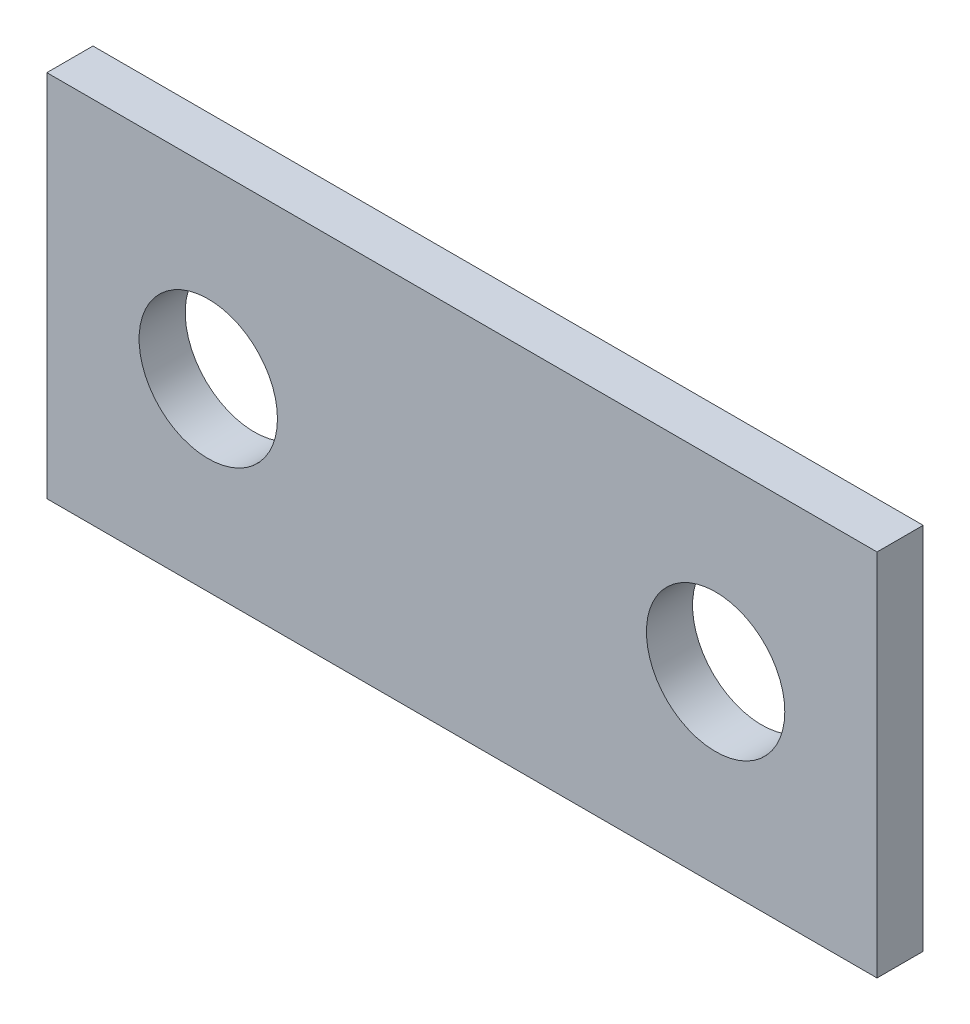
ISO-10303-21;
HEADER;
FILE_DESCRIPTION(('STEP AP214'),'2;1');
FILE_NAME('part.step','',(''),(''),'','','');
FILE_SCHEMA(('AUTOMOTIVE_DESIGN { 1 0 10303 214 1 1 1 1 }'));
ENDSEC;
DATA;
#1=APPLICATION_CONTEXT('core data for automotive mechanical design processes');
#2=APPLICATION_PROTOCOL_DEFINITION('international standard','automotive_design',2000,#1);
#3=PRODUCT_CONTEXT('',#1,'mechanical');
#4=PRODUCT('Part','Part','',(#3));
#5=PRODUCT_RELATED_PRODUCT_CATEGORY('part','',(#4));
#6=PRODUCT_DEFINITION_FORMATION('','',#4);
#7=PRODUCT_DEFINITION_CONTEXT('part definition',#1,'design');
#8=PRODUCT_DEFINITION('design','',#6,#7);
#9=PRODUCT_DEFINITION_SHAPE('','',#8);
#10=(LENGTH_UNIT() NAMED_UNIT(*) SI_UNIT(.MILLI.,.METRE.));
#11=(NAMED_UNIT(*) PLANE_ANGLE_UNIT() SI_UNIT($,.RADIAN.));
#12=(NAMED_UNIT(*) SI_UNIT($,.STERADIAN.) SOLID_ANGLE_UNIT());
#13=UNCERTAINTY_MEASURE_WITH_UNIT(LENGTH_MEASURE(1.E-05),#10,'distance_accuracy_value','');
#14=(GEOMETRIC_REPRESENTATION_CONTEXT(3) GLOBAL_UNCERTAINTY_ASSIGNED_CONTEXT((#13)) GLOBAL_UNIT_ASSIGNED_CONTEXT((#10,
#11,#12)) REPRESENTATION_CONTEXT('',''));
#15=CARTESIAN_POINT('',(0.,0.,0.));
#16=DIRECTION('',(0.,0.,1.));
#17=DIRECTION('',(1.,0.,0.));
#18=AXIS2_PLACEMENT_3D('',#15,#16,#17);
#19=CARTESIAN_POINT('',(-28.575,12.7,3.175));
#20=DIRECTION('',(0.,0.,1.));
#21=DIRECTION('',(1.,0.,0.));
#22=AXIS2_PLACEMENT_3D('',#19,#20,#21);
#23=PLANE('',#22);
#24=CARTESIAN_POINT('',(-17.4625,0.,3.175));
#25=DIRECTION('',(0.,0.,1.));
#26=DIRECTION('',(1.,0.,0.));
#27=AXIS2_PLACEMENT_3D('',#24,#25,#26);
#28=CIRCLE('',#27,4.7625);
#29=CARTESIAN_POINT('',(-12.7,0.,3.175));
#30=VERTEX_POINT('',#29);
#31=EDGE_CURVE('E101',#30,#30,#28,.T.);
#32=ORIENTED_EDGE('',*,*,#31,.F.);
#33=EDGE_LOOP('',(#32));
#34=FACE_BOUND('',#33,.T.);
#35=DIRECTION('',(0.,-1.,0.));
#36=VECTOR('',#35,1.);
#37=CARTESIAN_POINT('',(-28.575,-12.7,3.175));
#38=LINE('',#37,#36);
#39=CARTESIAN_POINT('',(-28.575,12.7,3.175));
#40=VERTEX_POINT('',#39);
#41=CARTESIAN_POINT('',(-28.575,-12.7,3.175));
#42=VERTEX_POINT('',#41);
#43=EDGE_CURVE('E86',#40,#42,#38,.T.);
#44=ORIENTED_EDGE('',*,*,#43,.T.);
#45=DIRECTION('',(1.,0.,0.));
#46=VECTOR('',#45,1.);
#47=CARTESIAN_POINT('',(28.575,-12.7,3.175));
#48=LINE('',#47,#46);
#49=CARTESIAN_POINT('',(28.575,-12.7,3.175));
#50=VERTEX_POINT('',#49);
#51=EDGE_CURVE('E81',#42,#50,#48,.T.);
#52=ORIENTED_EDGE('',*,*,#51,.T.);
#53=DIRECTION('',(0.,1.,0.));
#54=VECTOR('',#53,1.);
#55=CARTESIAN_POINT('',(28.575,-12.7,3.175));
#56=LINE('',#55,#54);
#57=CARTESIAN_POINT('',(28.575,12.7,3.175));
#58=VERTEX_POINT('',#57);
#59=EDGE_CURVE('E84',#50,#58,#56,.T.);
#60=ORIENTED_EDGE('',*,*,#59,.T.);
#61=DIRECTION('',(-1.,0.,0.));
#62=VECTOR('',#61,1.);
#63=CARTESIAN_POINT('',(28.575,12.7,3.175));
#64=LINE('',#63,#62);
#65=EDGE_CURVE('E51',#58,#40,#64,.T.);
#66=ORIENTED_EDGE('',*,*,#65,.T.);
#67=EDGE_LOOP('',(#44,#52,#60,#66));
#68=FACE_BOUND('',#67,.T.);
#69=CARTESIAN_POINT('',(17.4625,0.,3.175));
#70=DIRECTION('',(0.,0.,1.));
#71=DIRECTION('',(1.,0.,0.));
#72=AXIS2_PLACEMENT_3D('',#69,#70,#71);
#73=CIRCLE('',#72,4.7625);
#74=CARTESIAN_POINT('',(22.225,0.,3.175));
#75=VERTEX_POINT('',#74);
#76=EDGE_CURVE('E116',#75,#75,#73,.T.);
#77=ORIENTED_EDGE('',*,*,#76,.F.);
#78=EDGE_LOOP('',(#77));
#79=FACE_BOUND('',#78,.T.);
#80=ADVANCED_FACE('F34',(#34,#68,#79),#23,.T.);
#81=CARTESIAN_POINT('',(-28.575,12.7,0.));
#82=DIRECTION('',(0.,0.,1.));
#83=DIRECTION('',(1.,0.,0.));
#84=AXIS2_PLACEMENT_3D('',#81,#82,#83);
#85=PLANE('',#84);
#86=CARTESIAN_POINT('',(-17.4625,0.,0.));
#87=DIRECTION('',(0.,0.,1.));
#88=DIRECTION('',(1.,0.,0.));
#89=AXIS2_PLACEMENT_3D('',#86,#87,#88);
#90=CIRCLE('',#89,4.7625);
#91=CARTESIAN_POINT('',(-12.7,0.,0.));
#92=VERTEX_POINT('',#91);
#93=EDGE_CURVE('E113',#92,#92,#90,.T.);
#94=ORIENTED_EDGE('',*,*,#93,.T.);
#95=EDGE_LOOP('',(#94));
#96=FACE_BOUND('',#95,.T.);
#97=DIRECTION('',(0.,-1.,0.));
#98=VECTOR('',#97,1.);
#99=CARTESIAN_POINT('',(-28.575,-12.7,0.));
#100=LINE('',#99,#98);
#101=CARTESIAN_POINT('',(-28.575,12.7,0.));
#102=VERTEX_POINT('',#101);
#103=CARTESIAN_POINT('',(-28.575,-12.7,0.));
#104=VERTEX_POINT('',#103);
#105=EDGE_CURVE('E98',#102,#104,#100,.T.);
#106=ORIENTED_EDGE('',*,*,#105,.F.);
#107=DIRECTION('',(-1.,0.,0.));
#108=VECTOR('',#107,1.);
#109=CARTESIAN_POINT('',(28.575,12.7,0.));
#110=LINE('',#109,#108);
#111=CARTESIAN_POINT('',(28.575,12.7,0.));
#112=VERTEX_POINT('',#111);
#113=EDGE_CURVE('E74',#112,#102,#110,.T.);
#114=ORIENTED_EDGE('',*,*,#113,.F.);
#115=DIRECTION('',(0.,1.,0.));
#116=VECTOR('',#115,1.);
#117=CARTESIAN_POINT('',(28.575,-12.7,0.));
#118=LINE('',#117,#116);
#119=CARTESIAN_POINT('',(28.575,-12.7,0.));
#120=VERTEX_POINT('',#119);
#121=EDGE_CURVE('E68',#120,#112,#118,.T.);
#122=ORIENTED_EDGE('',*,*,#121,.F.);
#123=DIRECTION('',(1.,0.,0.));
#124=VECTOR('',#123,1.);
#125=CARTESIAN_POINT('',(28.575,-12.7,0.));
#126=LINE('',#125,#124);
#127=EDGE_CURVE('E90',#104,#120,#126,.T.);
#128=ORIENTED_EDGE('',*,*,#127,.F.);
#129=EDGE_LOOP('',(#106,#114,#122,#128));
#130=FACE_BOUND('',#129,.T.);
#131=CARTESIAN_POINT('',(17.4625,0.,0.));
#132=DIRECTION('',(0.,0.,1.));
#133=DIRECTION('',(1.,0.,0.));
#134=AXIS2_PLACEMENT_3D('',#131,#132,#133);
#135=CIRCLE('',#134,4.7625);
#136=CARTESIAN_POINT('',(22.225,0.,0.));
#137=VERTEX_POINT('',#136);
#138=EDGE_CURVE('E119',#137,#137,#135,.T.);
#139=ORIENTED_EDGE('',*,*,#138,.T.);
#140=EDGE_LOOP('',(#139));
#141=FACE_BOUND('',#140,.T.);
#142=ADVANCED_FACE('F109',(#96,#130,#141),#85,.F.);
#143=CARTESIAN_POINT('',(-28.575,-12.7,3.175));
#144=DIRECTION('',(1.,0.,0.));
#145=DIRECTION('',(0.,0.,-1.));
#146=AXIS2_PLACEMENT_3D('',#143,#144,#145);
#147=PLANE('',#146);
#148=ORIENTED_EDGE('',*,*,#105,.T.);
#149=DIRECTION('',(0.,0.,-1.));
#150=VECTOR('',#149,1.);
#151=CARTESIAN_POINT('',(-28.575,-12.7,3.175));
#152=LINE('',#151,#150);
#153=EDGE_CURVE('E11',#42,#104,#152,.T.);
#154=ORIENTED_EDGE('',*,*,#153,.F.);
#155=ORIENTED_EDGE('',*,*,#43,.F.);
#156=DIRECTION('',(0.,0.,-1.));
#157=VECTOR('',#156,1.);
#158=CARTESIAN_POINT('',(-28.575,12.7,3.175));
#159=LINE('',#158,#157);
#160=EDGE_CURVE('E94',#40,#102,#159,.T.);
#161=ORIENTED_EDGE('',*,*,#160,.T.);
#162=EDGE_LOOP('',(#148,#154,#155,#161));
#163=FACE_BOUND('',#162,.T.);
#164=ADVANCED_FACE('F36',(#163),#147,.F.);
#165=CARTESIAN_POINT('',(28.575,-12.7,3.175));
#166=DIRECTION('',(0.,1.,0.));
#167=DIRECTION('',(-1.,0.,0.));
#168=AXIS2_PLACEMENT_3D('',#165,#166,#167);
#169=PLANE('',#168);
#170=ORIENTED_EDGE('',*,*,#127,.T.);
#171=DIRECTION('',(0.,0.,-1.));
#172=VECTOR('',#171,1.);
#173=CARTESIAN_POINT('',(28.575,-12.7,3.175));
#174=LINE('',#173,#172);
#175=EDGE_CURVE('E43',#50,#120,#174,.T.);
#176=ORIENTED_EDGE('',*,*,#175,.F.);
#177=ORIENTED_EDGE('',*,*,#51,.F.);
#178=ORIENTED_EDGE('',*,*,#153,.T.);
#179=EDGE_LOOP('',(#170,#176,#177,#178));
#180=FACE_BOUND('',#179,.T.);
#181=ADVANCED_FACE('F89',(#180),#169,.F.);
#182=CARTESIAN_POINT('',(28.575,-12.7,3.175));
#183=DIRECTION('',(-1.,0.,0.));
#184=DIRECTION('',(0.,0.,1.));
#185=AXIS2_PLACEMENT_3D('',#182,#183,#184);
#186=PLANE('',#185);
#187=ORIENTED_EDGE('',*,*,#121,.T.);
#188=DIRECTION('',(0.,0.,-1.));
#189=VECTOR('',#188,1.);
#190=CARTESIAN_POINT('',(28.575,12.7,3.175));
#191=LINE('',#190,#189);
#192=EDGE_CURVE('E91',#58,#112,#191,.T.);
#193=ORIENTED_EDGE('',*,*,#192,.F.);
#194=ORIENTED_EDGE('',*,*,#59,.F.);
#195=ORIENTED_EDGE('',*,*,#175,.T.);
#196=EDGE_LOOP('',(#187,#193,#194,#195));
#197=FACE_BOUND('',#196,.T.);
#198=ADVANCED_FACE('F92',(#197),#186,.F.);
#199=CARTESIAN_POINT('',(28.575,12.7,3.175));
#200=DIRECTION('',(0.,-1.,0.));
#201=DIRECTION('',(1.,0.,0.));
#202=AXIS2_PLACEMENT_3D('',#199,#200,#201);
#203=PLANE('',#202);
#204=ORIENTED_EDGE('',*,*,#113,.T.);
#205=ORIENTED_EDGE('',*,*,#160,.F.);
#206=ORIENTED_EDGE('',*,*,#65,.F.);
#207=ORIENTED_EDGE('',*,*,#192,.T.);
#208=EDGE_LOOP('',(#204,#205,#206,#207));
#209=FACE_BOUND('',#208,.T.);
#210=ADVANCED_FACE('F106',(#209),#203,.F.);
#211=CARTESIAN_POINT('',(-17.4625,0.,3.175));
#212=DIRECTION('',(0.,0.,-1.));
#213=DIRECTION('',(-1.,0.,0.));
#214=AXIS2_PLACEMENT_3D('',#211,#212,#213);
#215=CYLINDRICAL_SURFACE('',#214,4.7625);
#216=ORIENTED_EDGE('',*,*,#31,.T.);
#217=EDGE_LOOP('',(#216));
#218=FACE_BOUND('',#217,.T.);
#219=ORIENTED_EDGE('',*,*,#93,.F.);
#220=EDGE_LOOP('',(#219));
#221=FACE_BOUND('',#220,.T.);
#222=ADVANCED_FACE('F137',(#218,#221),#215,.F.);
#223=CARTESIAN_POINT('',(17.4625,0.,3.175));
#224=DIRECTION('',(0.,0.,-1.));
#225=DIRECTION('',(-1.,0.,0.));
#226=AXIS2_PLACEMENT_3D('',#223,#224,#225);
#227=CYLINDRICAL_SURFACE('',#226,4.7625);
#228=ORIENTED_EDGE('',*,*,#76,.T.);
#229=EDGE_LOOP('',(#228));
#230=FACE_BOUND('',#229,.T.);
#231=ORIENTED_EDGE('',*,*,#138,.F.);
#232=EDGE_LOOP('',(#231));
#233=FACE_BOUND('',#232,.T.);
#234=ADVANCED_FACE('F125',(#230,#233),#227,.F.);
#235=CLOSED_SHELL('',(#80,#142,#164,#181,#198,#210,#222,#234));
#236=MANIFOLD_SOLID_BREP('B2',#235);
#237=ADVANCED_BREP_SHAPE_REPRESENTATION('',(#18,#236),#14);
#238=SHAPE_DEFINITION_REPRESENTATION(#9,#237);
ENDSEC;
END-ISO-10303-21;
